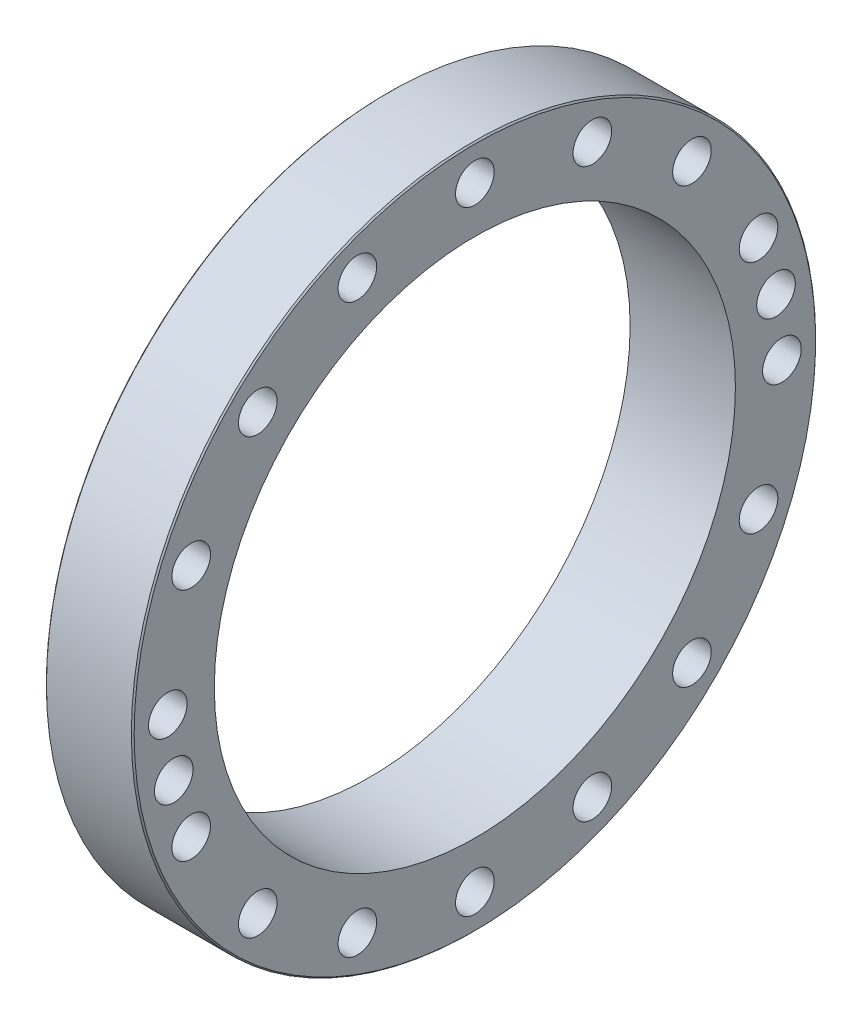
ISO-10303-21;
HEADER;
FILE_DESCRIPTION(('STEP AP214'),'2;1');
FILE_NAME('part.step','',(''),(''),'','','');
FILE_SCHEMA(('AUTOMOTIVE_DESIGN { 1 0 10303 214 1 1 1 1 }'));
ENDSEC;
DATA;
#1=APPLICATION_CONTEXT('core data for automotive mechanical design processes');
#2=APPLICATION_PROTOCOL_DEFINITION('international standard','automotive_design',2000,#1);
#3=PRODUCT_CONTEXT('',#1,'mechanical');
#4=PRODUCT('Part','Part','',(#3));
#5=PRODUCT_RELATED_PRODUCT_CATEGORY('part','',(#4));
#6=PRODUCT_DEFINITION_FORMATION('','',#4);
#7=PRODUCT_DEFINITION_CONTEXT('part definition',#1,'design');
#8=PRODUCT_DEFINITION('design','',#6,#7);
#9=PRODUCT_DEFINITION_SHAPE('','',#8);
#10=(LENGTH_UNIT() NAMED_UNIT(*) SI_UNIT(.MILLI.,.METRE.));
#11=(NAMED_UNIT(*) PLANE_ANGLE_UNIT() SI_UNIT($,.RADIAN.));
#12=(NAMED_UNIT(*) SI_UNIT($,.STERADIAN.) SOLID_ANGLE_UNIT());
#13=UNCERTAINTY_MEASURE_WITH_UNIT(LENGTH_MEASURE(1.E-05),#10,'distance_accuracy_value','');
#14=(GEOMETRIC_REPRESENTATION_CONTEXT(3) GLOBAL_UNCERTAINTY_ASSIGNED_CONTEXT((#13)) GLOBAL_UNIT_ASSIGNED_CONTEXT((#10,
#11,#12)) REPRESENTATION_CONTEXT('',''));
#15=CARTESIAN_POINT('',(0.,0.,0.));
#16=DIRECTION('',(0.,0.,1.));
#17=DIRECTION('',(1.,0.,0.));
#18=AXIS2_PLACEMENT_3D('',#15,#16,#17);
#19=CARTESIAN_POINT('',(55.6,-17.0704031764112,85.8187120352827));
#20=DIRECTION('',(-1.,0.,0.));
#21=DIRECTION('',(0.,0.,1.));
#22=AXIS2_PLACEMENT_3D('',#19,#20,#21);
#23=CYLINDRICAL_SURFACE('',#22,4.25);
#24=CARTESIAN_POINT('',(62.3499999999808,-17.0704031764112,85.8187120352827));
#25=DIRECTION('',(1.,0.,0.));
#26=DIRECTION('',(0.,0.195090322015708,-0.980785280403314));
#27=AXIS2_PLACEMENT_3D('',#24,#25,#26);
#28=CIRCLE('',#27,4.25000000001834);
#29=CARTESIAN_POINT('',(62.3499999999808,-16.2412693078409,81.6503745935506));
#30=VERTEX_POINT('',#29);
#31=EDGE_CURVE('E30',#30,#30,#28,.T.);
#32=ORIENTED_EDGE('',*,*,#31,.T.);
#33=EDGE_LOOP('',(#32));
#34=FACE_BOUND('',#33,.T.);
#35=CARTESIAN_POINT('',(48.8500000000158,-17.0704031764112,85.8187120352827));
#36=DIRECTION('',(-1.,0.,0.));
#37=DIRECTION('',(0.,0.195090322012491,-0.980785280403954));
#38=AXIS2_PLACEMENT_3D('',#35,#36,#37);
#39=CIRCLE('',#38,4.25000000001557);
#40=CARTESIAN_POINT('',(48.8500000000158,-16.2412693078551,81.6503745935506));
#41=VERTEX_POINT('',#40);
#42=EDGE_CURVE('E173',#41,#41,#39,.T.);
#43=ORIENTED_EDGE('',*,*,#42,.T.);
#44=EDGE_LOOP('',(#43));
#45=FACE_BOUND('',#44,.T.);
#46=ADVANCED_FACE('F15',(#34,#45),#23,.F.);
#47=CARTESIAN_POINT('',(55.6,17.0704031764112,-85.8187120352827));
#48=DIRECTION('',(-1.,0.,0.));
#49=DIRECTION('',(0.,0.,1.));
#50=AXIS2_PLACEMENT_3D('',#47,#48,#49);
#51=CYLINDRICAL_SURFACE('',#50,4.25);
#52=CARTESIAN_POINT('',(62.3499999999808,17.0704031764112,-85.8187120352827));
#53=DIRECTION('',(1.,0.,0.));
#54=DIRECTION('',(0.,-0.195090322015708,0.980785280403314));
#55=AXIS2_PLACEMENT_3D('',#52,#53,#54);
#56=CIRCLE('',#55,4.25000000001834);
#57=CARTESIAN_POINT('',(62.3499999999808,16.2412693078409,-81.6503745935506));
#58=VERTEX_POINT('',#57);
#59=EDGE_CURVE('E179',#58,#58,#56,.T.);
#60=ORIENTED_EDGE('',*,*,#59,.T.);
#61=EDGE_LOOP('',(#60));
#62=FACE_BOUND('',#61,.T.);
#63=CARTESIAN_POINT('',(48.8500000000158,17.0704031764112,-85.8187120352827));
#64=DIRECTION('',(-1.,0.,0.));
#65=DIRECTION('',(0.,-0.195090322012491,0.980785280403954));
#66=AXIS2_PLACEMENT_3D('',#63,#64,#65);
#67=CIRCLE('',#66,4.25000000001557);
#68=CARTESIAN_POINT('',(48.8500000000158,16.2412693078551,-81.6503745935506));
#69=VERTEX_POINT('',#68);
#70=EDGE_CURVE('E168',#69,#69,#67,.T.);
#71=ORIENTED_EDGE('',*,*,#70,.T.);
#72=EDGE_LOOP('',(#71));
#73=FACE_BOUND('',#72,.T.);
#74=ADVANCED_FACE('F191',(#62,#73),#51,.F.);
#75=CARTESIAN_POINT('',(63.0999999999062,-17.0704031764112,85.8187120352827));
#76=DIRECTION('',(1.,0.,0.));
#77=DIRECTION('',(0.,0.,-1.));
#78=AXIS2_PLACEMENT_3D('',#75,#76,#77);
#79=CONICAL_SURFACE('',#78,4.99999999996737,0.78539816341615);
#80=CARTESIAN_POINT('',(63.0999999999743,-17.0704031764112,85.8187120352827));
#81=DIRECTION('',(1.,0.,0.));
#82=DIRECTION('',(0.,0.,-1.));
#83=AXIS2_PLACEMENT_3D('',#80,#81,#82);
#84=CIRCLE('',#83,5.00000000003542);
#85=CARTESIAN_POINT('',(63.0999999999743,-17.0704031764112,80.8187120352473));
#86=VERTEX_POINT('',#85);
#87=EDGE_CURVE('E18',#86,#86,#84,.T.);
#88=ORIENTED_EDGE('',*,*,#87,.T.);
#89=EDGE_LOOP('',(#88));
#90=FACE_BOUND('',#89,.T.);
#91=ORIENTED_EDGE('',*,*,#31,.F.);
#92=EDGE_LOOP('',(#91));
#93=FACE_BOUND('',#92,.T.);
#94=ADVANCED_FACE('F188',(#90,#93),#79,.F.);
#95=CARTESIAN_POINT('',(63.0999999999062,17.0704031764112,-85.8187120352827));
#96=DIRECTION('',(1.,0.,0.));
#97=DIRECTION('',(0.,0.,-1.));
#98=AXIS2_PLACEMENT_3D('',#95,#96,#97);
#99=CONICAL_SURFACE('',#98,4.99999999996737,0.78539816341615);
#100=CARTESIAN_POINT('',(63.0999999999743,17.0704031764112,-85.8187120352827));
#101=DIRECTION('',(1.,0.,0.));
#102=DIRECTION('',(0.,0.,-1.));
#103=AXIS2_PLACEMENT_3D('',#100,#101,#102);
#104=CIRCLE('',#103,5.00000000003542);
#105=CARTESIAN_POINT('',(63.0999999999743,17.0704031764112,-90.8187120353181));
#106=VERTEX_POINT('',#105);
#107=EDGE_CURVE('E159',#106,#106,#104,.T.);
#108=ORIENTED_EDGE('',*,*,#107,.T.);
#109=EDGE_LOOP('',(#108));
#110=FACE_BOUND('',#109,.T.);
#111=ORIENTED_EDGE('',*,*,#59,.F.);
#112=EDGE_LOOP('',(#111));
#113=FACE_BOUND('',#112,.T.);
#114=ADVANCED_FACE('F190',(#110,#113),#99,.F.);
#115=CARTESIAN_POINT('',(48.1000000000336,-17.0704031764112,85.8187120352827));
#116=DIRECTION('',(-1.,0.,0.));
#117=DIRECTION('',(0.,0.,1.));
#118=AXIS2_PLACEMENT_3D('',#115,#116,#117);
#119=CONICAL_SURFACE('',#118,5.00000000002589,0.785398163416151);
#120=ORIENTED_EDGE('',*,*,#42,.F.);
#121=EDGE_LOOP('',(#120));
#122=FACE_BOUND('',#121,.T.);
#123=CARTESIAN_POINT('',(48.1000000000268,-17.0704031764112,85.8187120352827));
#124=DIRECTION('',(-1.,0.,0.));
#125=DIRECTION('',(0.,0.,1.));
#126=AXIS2_PLACEMENT_3D('',#123,#124,#125);
#127=CIRCLE('',#126,5.00000000003265);
#128=CARTESIAN_POINT('',(48.1000000000268,-17.0704031764112,90.8187120353153));
#129=VERTEX_POINT('',#128);
#130=EDGE_CURVE('E157',#129,#129,#127,.F.);
#131=ORIENTED_EDGE('',*,*,#130,.F.);
#132=EDGE_LOOP('',(#131));
#133=FACE_BOUND('',#132,.T.);
#134=ADVANCED_FACE('F198',(#122,#133),#119,.F.);
#135=CARTESIAN_POINT('',(48.1000000000336,17.0704031764112,-85.8187120352827));
#136=DIRECTION('',(-1.,0.,0.));
#137=DIRECTION('',(0.,0.,1.));
#138=AXIS2_PLACEMENT_3D('',#135,#136,#137);
#139=CONICAL_SURFACE('',#138,5.00000000002589,0.785398163416151);
#140=ORIENTED_EDGE('',*,*,#70,.F.);
#141=EDGE_LOOP('',(#140));
#142=FACE_BOUND('',#141,.T.);
#143=CARTESIAN_POINT('',(48.1000000000268,17.0704031764112,-85.8187120352827));
#144=DIRECTION('',(-1.,0.,0.));
#145=DIRECTION('',(0.,0.,1.));
#146=AXIS2_PLACEMENT_3D('',#143,#144,#145);
#147=CIRCLE('',#146,5.00000000003265);
#148=CARTESIAN_POINT('',(48.1000000000268,17.0704031764112,-80.8187120352501));
#149=VERTEX_POINT('',#148);
#150=EDGE_CURVE('E154',#149,#149,#147,.F.);
#151=ORIENTED_EDGE('',*,*,#150,.F.);
#152=EDGE_LOOP('',(#151));
#153=FACE_BOUND('',#152,.T.);
#154=ADVANCED_FACE('F317',(#142,#153),#139,.F.);
#155=CARTESIAN_POINT('',(46.,0.,0.));
#156=DIRECTION('',(-1.,0.,0.));
#157=DIRECTION('',(0.,0.,1.));
#158=AXIS2_PLACEMENT_3D('',#155,#156,#157);
#159=CYLINDRICAL_SURFACE('',#158,78.);
#160=CARTESIAN_POINT('',(48.1,0.,0.));
#161=DIRECTION('',(-1.,0.,0.));
#162=DIRECTION('',(0.,0.,1.));
#163=AXIS2_PLACEMENT_3D('',#160,#161,#162);
#164=CIRCLE('',#163,78.);
#165=CARTESIAN_POINT('',(48.1,0.,78.));
#166=VERTEX_POINT('',#165);
#167=EDGE_CURVE('E148',#166,#166,#164,.F.);
#168=ORIENTED_EDGE('',*,*,#167,.F.);
#169=EDGE_LOOP('',(#168));
#170=FACE_BOUND('',#169,.T.);
#171=CARTESIAN_POINT('',(43.9,0.,0.));
#172=DIRECTION('',(1.,0.,0.));
#173=DIRECTION('',(0.,0.,1.));
#174=AXIS2_PLACEMENT_3D('',#171,#172,#173);
#175=CIRCLE('',#174,78.);
#176=CARTESIAN_POINT('',(43.9,0.,78.));
#177=VERTEX_POINT('',#176);
#178=EDGE_CURVE('E164',#177,#177,#175,.F.);
#179=ORIENTED_EDGE('',*,*,#178,.F.);
#180=EDGE_LOOP('',(#179));
#181=FACE_BOUND('',#180,.T.);
#182=ADVANCED_FACE('F314',(#170,#181),#159,.T.);
#183=CARTESIAN_POINT('',(43.9,0.,0.));
#184=DIRECTION('',(1.,0.,0.));
#185=DIRECTION('',(0.,0.,-1.));
#186=AXIS2_PLACEMENT_3D('',#183,#184,#185);
#187=CONICAL_SURFACE('',#186,78.,0.785398163397448);
#188=ORIENTED_EDGE('',*,*,#178,.T.);
#189=EDGE_LOOP('',(#188));
#190=FACE_BOUND('',#189,.T.);
#191=CARTESIAN_POINT('',(43.1,0.,0.));
#192=DIRECTION('',(1.,0.,0.));
#193=DIRECTION('',(0.,0.,-1.));
#194=AXIS2_PLACEMENT_3D('',#191,#192,#193);
#195=CIRCLE('',#194,77.2);
#196=CARTESIAN_POINT('',(43.1,0.,-77.2));
#197=VERTEX_POINT('',#196);
#198=EDGE_CURVE('E145',#197,#197,#195,.F.);
#199=ORIENTED_EDGE('',*,*,#198,.F.);
#200=EDGE_LOOP('',(#199));
#201=FACE_BOUND('',#200,.T.);
#202=ADVANCED_FACE('F310',(#190,#201),#187,.T.);
#203=CARTESIAN_POINT('',(48.5,0.,0.));
#204=DIRECTION('',(1.,0.,0.));
#205=DIRECTION('',(0.,0.,-1.));
#206=AXIS2_PLACEMENT_3D('',#203,#204,#205);
#207=CONICAL_SURFACE('',#206,97.5,0.785398163397448);
#208=CARTESIAN_POINT('',(48.5,0.,0.));
#209=DIRECTION('',(-1.,0.,0.));
#210=DIRECTION('',(0.,0.,1.));
#211=AXIS2_PLACEMENT_3D('',#208,#209,#210);
#212=CIRCLE('',#211,97.5);
#213=CARTESIAN_POINT('',(48.5,0.,97.5));
#214=VERTEX_POINT('',#213);
#215=EDGE_CURVE('E144',#214,#214,#212,.F.);
#216=ORIENTED_EDGE('',*,*,#215,.F.);
#217=EDGE_LOOP('',(#216));
#218=FACE_BOUND('',#217,.T.);
#219=CARTESIAN_POINT('',(48.1,0.,0.));
#220=DIRECTION('',(1.,0.,0.));
#221=DIRECTION('',(0.,0.,-1.));
#222=AXIS2_PLACEMENT_3D('',#219,#220,#221);
#223=CIRCLE('',#222,97.1);
#224=CARTESIAN_POINT('',(48.1,0.,-97.1));
#225=VERTEX_POINT('',#224);
#226=EDGE_CURVE('E151',#225,#225,#223,.F.);
#227=ORIENTED_EDGE('',*,*,#226,.F.);
#228=EDGE_LOOP('',(#227));
#229=FACE_BOUND('',#228,.T.);
#230=ADVANCED_FACE('F306',(#218,#229),#207,.T.);
#231=CARTESIAN_POINT('',(63.1,-17.6069015619556,88.5158715563915));
#232=DIRECTION('',(-1.,0.,0.));
#233=DIRECTION('',(0.,0.,1.));
#234=AXIS2_PLACEMENT_3D('',#231,#232,#233);
#235=PLANE('',#234);
#236=CARTESIAN_POINT('',(63.1,-17.0704031764112,85.8187120352827));
#237=DIRECTION('',(-1.,0.,0.));
#238=DIRECTION('',(0.,0.,1.));
#239=AXIS2_PLACEMENT_3D('',#236,#237,#238);
#240=CIRCLE('',#239,5.5);
#241=CARTESIAN_POINT('',(63.1,-17.0704031764112,91.3187120352827));
#242=VERTEX_POINT('',#241);
#243=EDGE_CURVE('E141',#242,#242,#240,.F.);
#244=ORIENTED_EDGE('',*,*,#243,.T.);
#245=EDGE_LOOP('',(#244));
#246=FACE_BOUND('',#245,.T.);
#247=ORIENTED_EDGE('',*,*,#87,.F.);
#248=EDGE_LOOP('',(#247));
#249=FACE_BOUND('',#248,.T.);
#250=ADVANCED_FACE('F302',(#246,#249),#235,.F.);
#251=CARTESIAN_POINT('',(63.1,17.6069015619556,-88.5158715563915));
#252=DIRECTION('',(-1.,0.,0.));
#253=DIRECTION('',(0.,0.,1.));
#254=AXIS2_PLACEMENT_3D('',#251,#252,#253);
#255=PLANE('',#254);
#256=CARTESIAN_POINT('',(63.1,17.0704031764112,-85.8187120352827));
#257=DIRECTION('',(-1.,0.,0.));
#258=DIRECTION('',(0.,0.,1.));
#259=AXIS2_PLACEMENT_3D('',#256,#257,#258);
#260=CIRCLE('',#259,5.5);
#261=CARTESIAN_POINT('',(63.1,17.0704031764112,-80.3187120352827));
#262=VERTEX_POINT('',#261);
#263=EDGE_CURVE('E138',#262,#262,#260,.F.);
#264=ORIENTED_EDGE('',*,*,#263,.T.);
#265=EDGE_LOOP('',(#264));
#266=FACE_BOUND('',#265,.T.);
#267=ORIENTED_EDGE('',*,*,#107,.F.);
#268=EDGE_LOOP('',(#267));
#269=FACE_BOUND('',#268,.T.);
#270=ADVANCED_FACE('F298',(#266,#269),#255,.F.);
#271=CARTESIAN_POINT('',(48.1,0.,87.55));
#272=DIRECTION('',(-1.,0.,0.));
#273=DIRECTION('',(0.,0.,1.));
#274=AXIS2_PLACEMENT_3D('',#271,#272,#273);
#275=PLANE('',#274);
#276=ORIENTED_EDGE('',*,*,#167,.T.);
#277=EDGE_LOOP('',(#276));
#278=FACE_BOUND('',#277,.T.);
#279=ORIENTED_EDGE('',*,*,#226,.T.);
#280=EDGE_LOOP('',(#279));
#281=FACE_BOUND('',#280,.T.);
#282=CARTESIAN_POINT('',(48.1,0.,-87.5));
#283=DIRECTION('',(-1.,0.,0.));
#284=DIRECTION('',(0.,0.,1.));
#285=AXIS2_PLACEMENT_3D('',#282,#283,#284);
#286=CIRCLE('',#285,5.5);
#287=CARTESIAN_POINT('',(48.1,0.,-82.));
#288=VERTEX_POINT('',#287);
#289=EDGE_CURVE('E90',#288,#288,#286,.F.);
#290=ORIENTED_EDGE('',*,*,#289,.T.);
#291=EDGE_LOOP('',(#290));
#292=FACE_BOUND('',#291,.T.);
#293=CARTESIAN_POINT('',(48.1,33.4848003319454,-80.8394590947376));
#294=DIRECTION('',(-1.,0.,0.));
#295=DIRECTION('',(0.,0.,1.));
#296=AXIS2_PLACEMENT_3D('',#293,#294,#295);
#297=CIRCLE('',#296,5.5);
#298=CARTESIAN_POINT('',(48.1,33.4848003319454,-75.3394590947376));
#299=VERTEX_POINT('',#298);
#300=EDGE_CURVE('E93',#299,#299,#297,.F.);
#301=ORIENTED_EDGE('',*,*,#300,.T.);
#302=EDGE_LOOP('',(#301));
#303=FACE_BOUND('',#302,.T.);
#304=CARTESIAN_POINT('',(48.1,61.8718433538229,-61.8718433538229));
#305=DIRECTION('',(-1.,0.,0.));
#306=DIRECTION('',(0.,0.,1.));
#307=AXIS2_PLACEMENT_3D('',#304,#305,#306);
#308=CIRCLE('',#307,5.5);
#309=CARTESIAN_POINT('',(48.1,61.8718433538229,-56.3718433538229));
#310=VERTEX_POINT('',#309);
#311=EDGE_CURVE('E96',#310,#310,#308,.F.);
#312=ORIENTED_EDGE('',*,*,#311,.T.);
#313=EDGE_LOOP('',(#312));
#314=FACE_BOUND('',#313,.T.);
#315=CARTESIAN_POINT('',(48.1,80.8394590947376,-33.4848003319454));
#316=DIRECTION('',(-1.,0.,0.));
#317=DIRECTION('',(0.,0.,1.));
#318=AXIS2_PLACEMENT_3D('',#315,#316,#317);
#319=CIRCLE('',#318,5.5);
#320=CARTESIAN_POINT('',(48.1,80.8394590947376,-27.9848003319454));
#321=VERTEX_POINT('',#320);
#322=EDGE_CURVE('E99',#321,#321,#319,.F.);
#323=ORIENTED_EDGE('',*,*,#322,.T.);
#324=EDGE_LOOP('',(#323));
#325=FACE_BOUND('',#324,.T.);
#326=CARTESIAN_POINT('',(48.1,87.5,0.));
#327=DIRECTION('',(-1.,0.,0.));
#328=DIRECTION('',(0.,0.,1.));
#329=AXIS2_PLACEMENT_3D('',#326,#327,#328);
#330=CIRCLE('',#329,5.5);
#331=CARTESIAN_POINT('',(48.1,87.5,5.5));
#332=VERTEX_POINT('',#331);
#333=EDGE_CURVE('E102',#332,#332,#330,.F.);
#334=ORIENTED_EDGE('',*,*,#333,.T.);
#335=EDGE_LOOP('',(#334));
#336=FACE_BOUND('',#335,.T.);
#337=CARTESIAN_POINT('',(48.1,80.8394590947376,33.4848003319454));
#338=DIRECTION('',(-1.,0.,0.));
#339=DIRECTION('',(0.,0.,1.));
#340=AXIS2_PLACEMENT_3D('',#337,#338,#339);
#341=CIRCLE('',#340,5.5);
#342=CARTESIAN_POINT('',(48.1,80.8394590947376,38.9848003319454));
#343=VERTEX_POINT('',#342);
#344=EDGE_CURVE('E105',#343,#343,#341,.F.);
#345=ORIENTED_EDGE('',*,*,#344,.T.);
#346=EDGE_LOOP('',(#345));
#347=FACE_BOUND('',#346,.T.);
#348=CARTESIAN_POINT('',(48.1,61.8718433538229,61.8718433538229));
#349=DIRECTION('',(-1.,0.,0.));
#350=DIRECTION('',(0.,0.,1.));
#351=AXIS2_PLACEMENT_3D('',#348,#349,#350);
#352=CIRCLE('',#351,5.5);
#353=CARTESIAN_POINT('',(48.1,61.8718433538229,67.3718433538229));
#354=VERTEX_POINT('',#353);
#355=EDGE_CURVE('E108',#354,#354,#352,.F.);
#356=ORIENTED_EDGE('',*,*,#355,.T.);
#357=EDGE_LOOP('',(#356));
#358=FACE_BOUND('',#357,.T.);
#359=CARTESIAN_POINT('',(48.1,33.4848003319453,80.8394590947376));
#360=DIRECTION('',(-1.,0.,0.));
#361=DIRECTION('',(0.,0.,1.));
#362=AXIS2_PLACEMENT_3D('',#359,#360,#361);
#363=CIRCLE('',#362,5.5);
#364=CARTESIAN_POINT('',(48.1,33.4848003319453,86.3394590947376));
#365=VERTEX_POINT('',#364);
#366=EDGE_CURVE('E111',#365,#365,#363,.F.);
#367=ORIENTED_EDGE('',*,*,#366,.T.);
#368=EDGE_LOOP('',(#367));
#369=FACE_BOUND('',#368,.T.);
#370=CARTESIAN_POINT('',(48.1,0.,87.5));
#371=DIRECTION('',(-1.,0.,0.));
#372=DIRECTION('',(0.,0.,1.));
#373=AXIS2_PLACEMENT_3D('',#370,#371,#372);
#374=CIRCLE('',#373,5.5);
#375=CARTESIAN_POINT('',(48.1,0.,93.));
#376=VERTEX_POINT('',#375);
#377=EDGE_CURVE('E114',#376,#376,#374,.F.);
#378=ORIENTED_EDGE('',*,*,#377,.T.);
#379=EDGE_LOOP('',(#378));
#380=FACE_BOUND('',#379,.T.);
#381=CARTESIAN_POINT('',(48.1,-33.4848003319453,80.8394590947376));
#382=DIRECTION('',(-1.,0.,0.));
#383=DIRECTION('',(0.,0.,1.));
#384=AXIS2_PLACEMENT_3D('',#381,#382,#383);
#385=CIRCLE('',#384,5.5);
#386=CARTESIAN_POINT('',(48.1,-33.4848003319453,86.3394590947376));
#387=VERTEX_POINT('',#386);
#388=EDGE_CURVE('E117',#387,#387,#385,.F.);
#389=ORIENTED_EDGE('',*,*,#388,.T.);
#390=EDGE_LOOP('',(#389));
#391=FACE_BOUND('',#390,.T.);
#392=CARTESIAN_POINT('',(48.1,-61.8718433538229,61.8718433538229));
#393=DIRECTION('',(-1.,0.,0.));
#394=DIRECTION('',(0.,0.,1.));
#395=AXIS2_PLACEMENT_3D('',#392,#393,#394);
#396=CIRCLE('',#395,5.5);
#397=CARTESIAN_POINT('',(48.1,-61.8718433538229,67.3718433538229));
#398=VERTEX_POINT('',#397);
#399=EDGE_CURVE('E120',#398,#398,#396,.F.);
#400=ORIENTED_EDGE('',*,*,#399,.T.);
#401=EDGE_LOOP('',(#400));
#402=FACE_BOUND('',#401,.T.);
#403=CARTESIAN_POINT('',(48.1,-80.8394590947376,33.4848003319453));
#404=DIRECTION('',(-1.,0.,0.));
#405=DIRECTION('',(0.,0.,1.));
#406=AXIS2_PLACEMENT_3D('',#403,#404,#405);
#407=CIRCLE('',#406,5.5);
#408=CARTESIAN_POINT('',(48.1,-80.8394590947376,38.9848003319453));
#409=VERTEX_POINT('',#408);
#410=EDGE_CURVE('E123',#409,#409,#407,.F.);
#411=ORIENTED_EDGE('',*,*,#410,.T.);
#412=EDGE_LOOP('',(#411));
#413=FACE_BOUND('',#412,.T.);
#414=CARTESIAN_POINT('',(48.1,-87.5,0.));
#415=DIRECTION('',(-1.,0.,0.));
#416=DIRECTION('',(0.,0.,1.));
#417=AXIS2_PLACEMENT_3D('',#414,#415,#416);
#418=CIRCLE('',#417,5.5);
#419=CARTESIAN_POINT('',(48.1,-87.5,5.5));
#420=VERTEX_POINT('',#419);
#421=EDGE_CURVE('E126',#420,#420,#418,.F.);
#422=ORIENTED_EDGE('',*,*,#421,.T.);
#423=EDGE_LOOP('',(#422));
#424=FACE_BOUND('',#423,.T.);
#425=CARTESIAN_POINT('',(48.1,-80.8394590947376,-33.4848003319454));
#426=DIRECTION('',(-1.,0.,0.));
#427=DIRECTION('',(0.,0.,1.));
#428=AXIS2_PLACEMENT_3D('',#425,#426,#427);
#429=CIRCLE('',#428,5.5);
#430=CARTESIAN_POINT('',(48.1,-80.8394590947376,-27.9848003319454));
#431=VERTEX_POINT('',#430);
#432=EDGE_CURVE('E129',#431,#431,#429,.F.);
#433=ORIENTED_EDGE('',*,*,#432,.T.);
#434=EDGE_LOOP('',(#433));
#435=FACE_BOUND('',#434,.T.);
#436=CARTESIAN_POINT('',(48.1,-61.8718433538229,-61.871843353823));
#437=DIRECTION('',(-1.,0.,0.));
#438=DIRECTION('',(0.,0.,1.));
#439=AXIS2_PLACEMENT_3D('',#436,#437,#438);
#440=CIRCLE('',#439,5.5);
#441=CARTESIAN_POINT('',(48.1,-61.8718433538229,-56.371843353823));
#442=VERTEX_POINT('',#441);
#443=EDGE_CURVE('E132',#442,#442,#440,.F.);
#444=ORIENTED_EDGE('',*,*,#443,.T.);
#445=EDGE_LOOP('',(#444));
#446=FACE_BOUND('',#445,.T.);
#447=CARTESIAN_POINT('',(48.1,-33.4848003319453,-80.8394590947376));
#448=DIRECTION('',(-1.,0.,0.));
#449=DIRECTION('',(0.,0.,1.));
#450=AXIS2_PLACEMENT_3D('',#447,#448,#449);
#451=CIRCLE('',#450,5.5);
#452=CARTESIAN_POINT('',(48.1,-33.4848003319453,-75.3394590947376));
#453=VERTEX_POINT('',#452);
#454=EDGE_CURVE('E135',#453,#453,#451,.F.);
#455=ORIENTED_EDGE('',*,*,#454,.T.);
#456=EDGE_LOOP('',(#455));
#457=FACE_BOUND('',#456,.T.);
#458=ORIENTED_EDGE('',*,*,#150,.T.);
#459=EDGE_LOOP('',(#458));
#460=FACE_BOUND('',#459,.T.);
#461=ORIENTED_EDGE('',*,*,#130,.T.);
#462=EDGE_LOOP('',(#461));
#463=FACE_BOUND('',#462,.T.);
#464=ADVANCED_FACE('F294',(#278,#281,#292,#303,#314,#325,#336,#347,#358,#369,#380,#391,#402,
#413,#424,#435,#446,#457,#460,#463),#275,.T.);
#465=CARTESIAN_POINT('',(43.1,0.,75.7265));
#466=DIRECTION('',(-1.,0.,0.));
#467=DIRECTION('',(0.,0.,1.));
#468=AXIS2_PLACEMENT_3D('',#465,#466,#467);
#469=PLANE('',#468);
#470=CARTESIAN_POINT('',(43.1,0.,0.));
#471=DIRECTION('',(-1.,0.,0.));
#472=DIRECTION('',(0.,0.,1.));
#473=AXIS2_PLACEMENT_3D('',#470,#471,#472);
#474=CIRCLE('',#473,74.253);
#475=CARTESIAN_POINT('',(43.1,0.,74.253));
#476=VERTEX_POINT('',#475);
#477=EDGE_CURVE('E87',#476,#476,#474,.F.);
#478=ORIENTED_EDGE('',*,*,#477,.T.);
#479=EDGE_LOOP('',(#478));
#480=FACE_BOUND('',#479,.T.);
#481=ORIENTED_EDGE('',*,*,#198,.T.);
#482=EDGE_LOOP('',(#481));
#483=FACE_BOUND('',#482,.T.);
#484=ADVANCED_FACE('F290',(#480,#483),#469,.T.);
#485=CARTESIAN_POINT('',(60.6,0.,0.));
#486=DIRECTION('',(-1.,0.,0.));
#487=DIRECTION('',(0.,0.,1.));
#488=AXIS2_PLACEMENT_3D('',#485,#486,#487);
#489=CYLINDRICAL_SURFACE('',#488,97.5);
#490=CARTESIAN_POINT('',(72.7,0.,0.));
#491=DIRECTION('',(-1.,0.,0.));
#492=DIRECTION('',(0.,0.,1.));
#493=AXIS2_PLACEMENT_3D('',#490,#491,#492);
#494=CIRCLE('',#493,97.5);
#495=CARTESIAN_POINT('',(72.7,0.,97.5));
#496=VERTEX_POINT('',#495);
#497=EDGE_CURVE('E86',#496,#496,#494,.F.);
#498=ORIENTED_EDGE('',*,*,#497,.F.);
#499=EDGE_LOOP('',(#498));
#500=FACE_BOUND('',#499,.T.);
#501=ORIENTED_EDGE('',*,*,#215,.T.);
#502=EDGE_LOOP('',(#501));
#503=FACE_BOUND('',#502,.T.);
#504=ADVANCED_FACE('F286',(#500,#503),#489,.T.);
#505=CARTESIAN_POINT('',(68.1,-17.0704031764112,85.8187120352827));
#506=DIRECTION('',(-1.,0.,0.));
#507=DIRECTION('',(0.,0.,1.));
#508=AXIS2_PLACEMENT_3D('',#505,#506,#507);
#509=CYLINDRICAL_SURFACE('',#508,5.5);
#510=CARTESIAN_POINT('',(73.1,-17.0704031764112,85.8187120352827));
#511=DIRECTION('',(-1.,0.,0.));
#512=DIRECTION('',(0.,0.,1.));
#513=AXIS2_PLACEMENT_3D('',#510,#511,#512);
#514=CIRCLE('',#513,5.5);
#515=CARTESIAN_POINT('',(73.1,-17.0704031764112,91.3187120352827));
#516=VERTEX_POINT('',#515);
#517=EDGE_CURVE('E83',#516,#516,#514,.T.);
#518=ORIENTED_EDGE('',*,*,#517,.F.);
#519=EDGE_LOOP('',(#518));
#520=FACE_BOUND('',#519,.T.);
#521=ORIENTED_EDGE('',*,*,#243,.F.);
#522=EDGE_LOOP('',(#521));
#523=FACE_BOUND('',#522,.T.);
#524=ADVANCED_FACE('F282',(#520,#523),#509,.F.);
#525=CARTESIAN_POINT('',(68.1,17.0704031764112,-85.8187120352827));
#526=DIRECTION('',(-1.,0.,0.));
#527=DIRECTION('',(0.,0.,1.));
#528=AXIS2_PLACEMENT_3D('',#525,#526,#527);
#529=CYLINDRICAL_SURFACE('',#528,5.5);
#530=CARTESIAN_POINT('',(73.1,17.0704031764112,-85.8187120352827));
#531=DIRECTION('',(-1.,0.,0.));
#532=DIRECTION('',(0.,0.,1.));
#533=AXIS2_PLACEMENT_3D('',#530,#531,#532);
#534=CIRCLE('',#533,5.5);
#535=CARTESIAN_POINT('',(73.1,17.0704031764112,-80.3187120352827));
#536=VERTEX_POINT('',#535);
#537=EDGE_CURVE('E80',#536,#536,#534,.T.);
#538=ORIENTED_EDGE('',*,*,#537,.F.);
#539=EDGE_LOOP('',(#538));
#540=FACE_BOUND('',#539,.T.);
#541=ORIENTED_EDGE('',*,*,#263,.F.);
#542=EDGE_LOOP('',(#541));
#543=FACE_BOUND('',#542,.T.);
#544=ADVANCED_FACE('F278',(#540,#543),#529,.F.);
#545=CARTESIAN_POINT('',(60.6,-33.4848003319453,-80.8394590947376));
#546=DIRECTION('',(-1.,0.,0.));
#547=DIRECTION('',(0.,0.,1.));
#548=AXIS2_PLACEMENT_3D('',#545,#546,#547);
#549=CYLINDRICAL_SURFACE('',#548,5.5);
#550=CARTESIAN_POINT('',(73.1,-33.4848003319453,-80.8394590947376));
#551=DIRECTION('',(-1.,0.,0.));
#552=DIRECTION('',(0.,0.,1.));
#553=AXIS2_PLACEMENT_3D('',#550,#551,#552);
#554=CIRCLE('',#553,5.5);
#555=CARTESIAN_POINT('',(73.1,-33.4848003319453,-75.3394590947376));
#556=VERTEX_POINT('',#555);
#557=EDGE_CURVE('E77',#556,#556,#554,.T.);
#558=ORIENTED_EDGE('',*,*,#557,.F.);
#559=EDGE_LOOP('',(#558));
#560=FACE_BOUND('',#559,.T.);
#561=ORIENTED_EDGE('',*,*,#454,.F.);
#562=EDGE_LOOP('',(#561));
#563=FACE_BOUND('',#562,.T.);
#564=ADVANCED_FACE('F274',(#560,#563),#549,.F.);
#565=CARTESIAN_POINT('',(60.6,-61.8718433538229,-61.871843353823));
#566=DIRECTION('',(-1.,0.,0.));
#567=DIRECTION('',(0.,0.,1.));
#568=AXIS2_PLACEMENT_3D('',#565,#566,#567);
#569=CYLINDRICAL_SURFACE('',#568,5.5);
#570=CARTESIAN_POINT('',(73.1,-61.8718433538229,-61.871843353823));
#571=DIRECTION('',(-1.,0.,0.));
#572=DIRECTION('',(0.,0.,1.));
#573=AXIS2_PLACEMENT_3D('',#570,#571,#572);
#574=CIRCLE('',#573,5.5);
#575=CARTESIAN_POINT('',(73.1,-61.8718433538229,-56.371843353823));
#576=VERTEX_POINT('',#575);
#577=EDGE_CURVE('E74',#576,#576,#574,.T.);
#578=ORIENTED_EDGE('',*,*,#577,.F.);
#579=EDGE_LOOP('',(#578));
#580=FACE_BOUND('',#579,.T.);
#581=ORIENTED_EDGE('',*,*,#443,.F.);
#582=EDGE_LOOP('',(#581));
#583=FACE_BOUND('',#582,.T.);
#584=ADVANCED_FACE('F270',(#580,#583),#569,.F.);
#585=CARTESIAN_POINT('',(60.6,-80.8394590947376,-33.4848003319454));
#586=DIRECTION('',(-1.,0.,0.));
#587=DIRECTION('',(0.,0.,1.));
#588=AXIS2_PLACEMENT_3D('',#585,#586,#587);
#589=CYLINDRICAL_SURFACE('',#588,5.5);
#590=CARTESIAN_POINT('',(73.1,-80.8394590947376,-33.4848003319454));
#591=DIRECTION('',(-1.,0.,0.));
#592=DIRECTION('',(0.,0.,1.));
#593=AXIS2_PLACEMENT_3D('',#590,#591,#592);
#594=CIRCLE('',#593,5.5);
#595=CARTESIAN_POINT('',(73.1,-80.8394590947376,-27.9848003319454));
#596=VERTEX_POINT('',#595);
#597=EDGE_CURVE('E71',#596,#596,#594,.T.);
#598=ORIENTED_EDGE('',*,*,#597,.F.);
#599=EDGE_LOOP('',(#598));
#600=FACE_BOUND('',#599,.T.);
#601=ORIENTED_EDGE('',*,*,#432,.F.);
#602=EDGE_LOOP('',(#601));
#603=FACE_BOUND('',#602,.T.);
#604=ADVANCED_FACE('F266',(#600,#603),#589,.F.);
#605=CARTESIAN_POINT('',(60.6,-87.5,0.));
#606=DIRECTION('',(-1.,0.,0.));
#607=DIRECTION('',(0.,0.,1.));
#608=AXIS2_PLACEMENT_3D('',#605,#606,#607);
#609=CYLINDRICAL_SURFACE('',#608,5.5);
#610=CARTESIAN_POINT('',(73.1,-87.5,0.));
#611=DIRECTION('',(-1.,0.,0.));
#612=DIRECTION('',(0.,0.,1.));
#613=AXIS2_PLACEMENT_3D('',#610,#611,#612);
#614=CIRCLE('',#613,5.5);
#615=CARTESIAN_POINT('',(73.1,-87.5,5.5));
#616=VERTEX_POINT('',#615);
#617=EDGE_CURVE('E68',#616,#616,#614,.T.);
#618=ORIENTED_EDGE('',*,*,#617,.F.);
#619=EDGE_LOOP('',(#618));
#620=FACE_BOUND('',#619,.T.);
#621=ORIENTED_EDGE('',*,*,#421,.F.);
#622=EDGE_LOOP('',(#621));
#623=FACE_BOUND('',#622,.T.);
#624=ADVANCED_FACE('F262',(#620,#623),#609,.F.);
#625=CARTESIAN_POINT('',(60.6,-80.8394590947376,33.4848003319453));
#626=DIRECTION('',(-1.,0.,0.));
#627=DIRECTION('',(0.,0.,1.));
#628=AXIS2_PLACEMENT_3D('',#625,#626,#627);
#629=CYLINDRICAL_SURFACE('',#628,5.5);
#630=CARTESIAN_POINT('',(73.1,-80.8394590947376,33.4848003319453));
#631=DIRECTION('',(-1.,0.,0.));
#632=DIRECTION('',(0.,0.,1.));
#633=AXIS2_PLACEMENT_3D('',#630,#631,#632);
#634=CIRCLE('',#633,5.5);
#635=CARTESIAN_POINT('',(73.1,-80.8394590947376,38.9848003319453));
#636=VERTEX_POINT('',#635);
#637=EDGE_CURVE('E65',#636,#636,#634,.T.);
#638=ORIENTED_EDGE('',*,*,#637,.F.);
#639=EDGE_LOOP('',(#638));
#640=FACE_BOUND('',#639,.T.);
#641=ORIENTED_EDGE('',*,*,#410,.F.);
#642=EDGE_LOOP('',(#641));
#643=FACE_BOUND('',#642,.T.);
#644=ADVANCED_FACE('F258',(#640,#643),#629,.F.);
#645=CARTESIAN_POINT('',(60.6,-61.8718433538229,61.8718433538229));
#646=DIRECTION('',(-1.,0.,0.));
#647=DIRECTION('',(0.,0.,1.));
#648=AXIS2_PLACEMENT_3D('',#645,#646,#647);
#649=CYLINDRICAL_SURFACE('',#648,5.5);
#650=CARTESIAN_POINT('',(73.1,-61.8718433538229,61.8718433538229));
#651=DIRECTION('',(-1.,0.,0.));
#652=DIRECTION('',(0.,0.,1.));
#653=AXIS2_PLACEMENT_3D('',#650,#651,#652);
#654=CIRCLE('',#653,5.5);
#655=CARTESIAN_POINT('',(73.1,-61.8718433538229,67.3718433538229));
#656=VERTEX_POINT('',#655);
#657=EDGE_CURVE('E62',#656,#656,#654,.T.);
#658=ORIENTED_EDGE('',*,*,#657,.F.);
#659=EDGE_LOOP('',(#658));
#660=FACE_BOUND('',#659,.T.);
#661=ORIENTED_EDGE('',*,*,#399,.F.);
#662=EDGE_LOOP('',(#661));
#663=FACE_BOUND('',#662,.T.);
#664=ADVANCED_FACE('F254',(#660,#663),#649,.F.);
#665=CARTESIAN_POINT('',(60.6,-33.4848003319453,80.8394590947376));
#666=DIRECTION('',(-1.,0.,0.));
#667=DIRECTION('',(0.,0.,1.));
#668=AXIS2_PLACEMENT_3D('',#665,#666,#667);
#669=CYLINDRICAL_SURFACE('',#668,5.5);
#670=CARTESIAN_POINT('',(73.1,-33.4848003319453,80.8394590947376));
#671=DIRECTION('',(-1.,0.,0.));
#672=DIRECTION('',(0.,0.,1.));
#673=AXIS2_PLACEMENT_3D('',#670,#671,#672);
#674=CIRCLE('',#673,5.5);
#675=CARTESIAN_POINT('',(73.1,-33.4848003319453,86.3394590947376));
#676=VERTEX_POINT('',#675);
#677=EDGE_CURVE('E59',#676,#676,#674,.T.);
#678=ORIENTED_EDGE('',*,*,#677,.F.);
#679=EDGE_LOOP('',(#678));
#680=FACE_BOUND('',#679,.T.);
#681=ORIENTED_EDGE('',*,*,#388,.F.);
#682=EDGE_LOOP('',(#681));
#683=FACE_BOUND('',#682,.T.);
#684=ADVANCED_FACE('F250',(#680,#683),#669,.F.);
#685=CARTESIAN_POINT('',(60.6,0.,87.5));
#686=DIRECTION('',(-1.,0.,0.));
#687=DIRECTION('',(0.,0.,1.));
#688=AXIS2_PLACEMENT_3D('',#685,#686,#687);
#689=CYLINDRICAL_SURFACE('',#688,5.5);
#690=CARTESIAN_POINT('',(73.1,0.,87.5));
#691=DIRECTION('',(-1.,0.,0.));
#692=DIRECTION('',(0.,0.,1.));
#693=AXIS2_PLACEMENT_3D('',#690,#691,#692);
#694=CIRCLE('',#693,5.5);
#695=CARTESIAN_POINT('',(73.1,0.,93.));
#696=VERTEX_POINT('',#695);
#697=EDGE_CURVE('E56',#696,#696,#694,.T.);
#698=ORIENTED_EDGE('',*,*,#697,.F.);
#699=EDGE_LOOP('',(#698));
#700=FACE_BOUND('',#699,.T.);
#701=ORIENTED_EDGE('',*,*,#377,.F.);
#702=EDGE_LOOP('',(#701));
#703=FACE_BOUND('',#702,.T.);
#704=ADVANCED_FACE('F246',(#700,#703),#689,.F.);
#705=CARTESIAN_POINT('',(60.6,33.4848003319453,80.8394590947376));
#706=DIRECTION('',(-1.,0.,0.));
#707=DIRECTION('',(0.,0.,1.));
#708=AXIS2_PLACEMENT_3D('',#705,#706,#707);
#709=CYLINDRICAL_SURFACE('',#708,5.5);
#710=CARTESIAN_POINT('',(73.1,33.4848003319453,80.8394590947376));
#711=DIRECTION('',(-1.,0.,0.));
#712=DIRECTION('',(0.,0.,1.));
#713=AXIS2_PLACEMENT_3D('',#710,#711,#712);
#714=CIRCLE('',#713,5.5);
#715=CARTESIAN_POINT('',(73.1,33.4848003319453,86.3394590947376));
#716=VERTEX_POINT('',#715);
#717=EDGE_CURVE('E53',#716,#716,#714,.T.);
#718=ORIENTED_EDGE('',*,*,#717,.F.);
#719=EDGE_LOOP('',(#718));
#720=FACE_BOUND('',#719,.T.);
#721=ORIENTED_EDGE('',*,*,#366,.F.);
#722=EDGE_LOOP('',(#721));
#723=FACE_BOUND('',#722,.T.);
#724=ADVANCED_FACE('F242',(#720,#723),#709,.F.);
#725=CARTESIAN_POINT('',(60.6,61.8718433538229,61.8718433538229));
#726=DIRECTION('',(-1.,0.,0.));
#727=DIRECTION('',(0.,0.,1.));
#728=AXIS2_PLACEMENT_3D('',#725,#726,#727);
#729=CYLINDRICAL_SURFACE('',#728,5.5);
#730=CARTESIAN_POINT('',(73.1,61.8718433538229,61.8718433538229));
#731=DIRECTION('',(-1.,0.,0.));
#732=DIRECTION('',(0.,0.,1.));
#733=AXIS2_PLACEMENT_3D('',#730,#731,#732);
#734=CIRCLE('',#733,5.5);
#735=CARTESIAN_POINT('',(73.1,61.8718433538229,67.3718433538229));
#736=VERTEX_POINT('',#735);
#737=EDGE_CURVE('E50',#736,#736,#734,.T.);
#738=ORIENTED_EDGE('',*,*,#737,.F.);
#739=EDGE_LOOP('',(#738));
#740=FACE_BOUND('',#739,.T.);
#741=ORIENTED_EDGE('',*,*,#355,.F.);
#742=EDGE_LOOP('',(#741));
#743=FACE_BOUND('',#742,.T.);
#744=ADVANCED_FACE('F238',(#740,#743),#729,.F.);
#745=CARTESIAN_POINT('',(60.6,80.8394590947376,33.4848003319454));
#746=DIRECTION('',(-1.,0.,0.));
#747=DIRECTION('',(0.,0.,1.));
#748=AXIS2_PLACEMENT_3D('',#745,#746,#747);
#749=CYLINDRICAL_SURFACE('',#748,5.5);
#750=CARTESIAN_POINT('',(73.1,80.8394590947376,33.4848003319454));
#751=DIRECTION('',(-1.,0.,0.));
#752=DIRECTION('',(0.,0.,1.));
#753=AXIS2_PLACEMENT_3D('',#750,#751,#752);
#754=CIRCLE('',#753,5.5);
#755=CARTESIAN_POINT('',(73.1,80.8394590947376,38.9848003319454));
#756=VERTEX_POINT('',#755);
#757=EDGE_CURVE('E47',#756,#756,#754,.T.);
#758=ORIENTED_EDGE('',*,*,#757,.F.);
#759=EDGE_LOOP('',(#758));
#760=FACE_BOUND('',#759,.T.);
#761=ORIENTED_EDGE('',*,*,#344,.F.);
#762=EDGE_LOOP('',(#761));
#763=FACE_BOUND('',#762,.T.);
#764=ADVANCED_FACE('F234',(#760,#763),#749,.F.);
#765=CARTESIAN_POINT('',(60.6,87.5,0.));
#766=DIRECTION('',(-1.,0.,0.));
#767=DIRECTION('',(0.,0.,1.));
#768=AXIS2_PLACEMENT_3D('',#765,#766,#767);
#769=CYLINDRICAL_SURFACE('',#768,5.5);
#770=CARTESIAN_POINT('',(73.1,87.5,0.));
#771=DIRECTION('',(-1.,0.,0.));
#772=DIRECTION('',(0.,0.,1.));
#773=AXIS2_PLACEMENT_3D('',#770,#771,#772);
#774=CIRCLE('',#773,5.5);
#775=CARTESIAN_POINT('',(73.1,87.5,5.5));
#776=VERTEX_POINT('',#775);
#777=EDGE_CURVE('E44',#776,#776,#774,.T.);
#778=ORIENTED_EDGE('',*,*,#777,.F.);
#779=EDGE_LOOP('',(#778));
#780=FACE_BOUND('',#779,.T.);
#781=ORIENTED_EDGE('',*,*,#333,.F.);
#782=EDGE_LOOP('',(#781));
#783=FACE_BOUND('',#782,.T.);
#784=ADVANCED_FACE('F230',(#780,#783),#769,.F.);
#785=CARTESIAN_POINT('',(60.6,80.8394590947376,-33.4848003319454));
#786=DIRECTION('',(-1.,0.,0.));
#787=DIRECTION('',(0.,0.,1.));
#788=AXIS2_PLACEMENT_3D('',#785,#786,#787);
#789=CYLINDRICAL_SURFACE('',#788,5.5);
#790=CARTESIAN_POINT('',(73.1,80.8394590947376,-33.4848003319454));
#791=DIRECTION('',(-1.,0.,0.));
#792=DIRECTION('',(0.,0.,1.));
#793=AXIS2_PLACEMENT_3D('',#790,#791,#792);
#794=CIRCLE('',#793,5.5);
#795=CARTESIAN_POINT('',(73.1,80.8394590947376,-27.9848003319454));
#796=VERTEX_POINT('',#795);
#797=EDGE_CURVE('E41',#796,#796,#794,.T.);
#798=ORIENTED_EDGE('',*,*,#797,.F.);
#799=EDGE_LOOP('',(#798));
#800=FACE_BOUND('',#799,.T.);
#801=ORIENTED_EDGE('',*,*,#322,.F.);
#802=EDGE_LOOP('',(#801));
#803=FACE_BOUND('',#802,.T.);
#804=ADVANCED_FACE('F226',(#800,#803),#789,.F.);
#805=CARTESIAN_POINT('',(60.6,61.8718433538229,-61.8718433538229));
#806=DIRECTION('',(-1.,0.,0.));
#807=DIRECTION('',(0.,0.,1.));
#808=AXIS2_PLACEMENT_3D('',#805,#806,#807);
#809=CYLINDRICAL_SURFACE('',#808,5.5);
#810=CARTESIAN_POINT('',(73.1,61.8718433538229,-61.8718433538229));
#811=DIRECTION('',(-1.,0.,0.));
#812=DIRECTION('',(0.,0.,1.));
#813=AXIS2_PLACEMENT_3D('',#810,#811,#812);
#814=CIRCLE('',#813,5.5);
#815=CARTESIAN_POINT('',(73.1,61.8718433538229,-56.3718433538229));
#816=VERTEX_POINT('',#815);
#817=EDGE_CURVE('E38',#816,#816,#814,.T.);
#818=ORIENTED_EDGE('',*,*,#817,.F.);
#819=EDGE_LOOP('',(#818));
#820=FACE_BOUND('',#819,.T.);
#821=ORIENTED_EDGE('',*,*,#311,.F.);
#822=EDGE_LOOP('',(#821));
#823=FACE_BOUND('',#822,.T.);
#824=ADVANCED_FACE('F222',(#820,#823),#809,.F.);
#825=CARTESIAN_POINT('',(60.6,33.4848003319454,-80.8394590947376));
#826=DIRECTION('',(-1.,0.,0.));
#827=DIRECTION('',(0.,0.,1.));
#828=AXIS2_PLACEMENT_3D('',#825,#826,#827);
#829=CYLINDRICAL_SURFACE('',#828,5.5);
#830=CARTESIAN_POINT('',(73.1,33.4848003319454,-80.8394590947376));
#831=DIRECTION('',(-1.,0.,0.));
#832=DIRECTION('',(0.,0.,1.));
#833=AXIS2_PLACEMENT_3D('',#830,#831,#832);
#834=CIRCLE('',#833,5.5);
#835=CARTESIAN_POINT('',(73.1,33.4848003319454,-75.3394590947376));
#836=VERTEX_POINT('',#835);
#837=EDGE_CURVE('E35',#836,#836,#834,.T.);
#838=ORIENTED_EDGE('',*,*,#837,.F.);
#839=EDGE_LOOP('',(#838));
#840=FACE_BOUND('',#839,.T.);
#841=ORIENTED_EDGE('',*,*,#300,.F.);
#842=EDGE_LOOP('',(#841));
#843=FACE_BOUND('',#842,.T.);
#844=ADVANCED_FACE('F218',(#840,#843),#829,.F.);
#845=CARTESIAN_POINT('',(60.6,0.,-87.5));
#846=DIRECTION('',(-1.,0.,0.));
#847=DIRECTION('',(0.,0.,1.));
#848=AXIS2_PLACEMENT_3D('',#845,#846,#847);
#849=CYLINDRICAL_SURFACE('',#848,5.5);
#850=CARTESIAN_POINT('',(73.1,0.,-87.5));
#851=DIRECTION('',(-1.,0.,0.));
#852=DIRECTION('',(0.,0.,1.));
#853=AXIS2_PLACEMENT_3D('',#850,#851,#852);
#854=CIRCLE('',#853,5.5);
#855=CARTESIAN_POINT('',(73.1,0.,-82.));
#856=VERTEX_POINT('',#855);
#857=EDGE_CURVE('E27',#856,#856,#854,.T.);
#858=ORIENTED_EDGE('',*,*,#857,.F.);
#859=EDGE_LOOP('',(#858));
#860=FACE_BOUND('',#859,.T.);
#861=ORIENTED_EDGE('',*,*,#289,.F.);
#862=EDGE_LOOP('',(#861));
#863=FACE_BOUND('',#862,.T.);
#864=ADVANCED_FACE('F214',(#860,#863),#849,.F.);
#865=CARTESIAN_POINT('',(58.1,0.,0.));
#866=DIRECTION('',(-1.,0.,0.));
#867=DIRECTION('',(0.,0.,1.));
#868=AXIS2_PLACEMENT_3D('',#865,#866,#867);
#869=CYLINDRICAL_SURFACE('',#868,74.253);
#870=ORIENTED_EDGE('',*,*,#477,.F.);
#871=EDGE_LOOP('',(#870));
#872=FACE_BOUND('',#871,.T.);
#873=CARTESIAN_POINT('',(73.1,0.,0.));
#874=DIRECTION('',(-1.,0.,0.));
#875=DIRECTION('',(0.,0.,1.));
#876=AXIS2_PLACEMENT_3D('',#873,#874,#875);
#877=CIRCLE('',#876,74.253);
#878=CARTESIAN_POINT('',(73.1,0.,74.253));
#879=VERTEX_POINT('',#878);
#880=EDGE_CURVE('E22',#879,#879,#877,.T.);
#881=ORIENTED_EDGE('',*,*,#880,.F.);
#882=EDGE_LOOP('',(#881));
#883=FACE_BOUND('',#882,.T.);
#884=ADVANCED_FACE('F207',(#872,#883),#869,.F.);
#885=CARTESIAN_POINT('',(72.7,0.,0.));
#886=DIRECTION('',(-1.,0.,0.));
#887=DIRECTION('',(0.,0.,1.));
#888=AXIS2_PLACEMENT_3D('',#885,#886,#887);
#889=CONICAL_SURFACE('',#888,97.5,0.785398163397448);
#890=CARTESIAN_POINT('',(73.1,0.,0.));
#891=DIRECTION('',(-1.,0.,0.));
#892=DIRECTION('',(0.,0.,1.));
#893=AXIS2_PLACEMENT_3D('',#890,#891,#892);
#894=CIRCLE('',#893,97.1);
#895=CARTESIAN_POINT('',(73.1,0.,97.1));
#896=VERTEX_POINT('',#895);
#897=EDGE_CURVE('E10',#896,#896,#894,.F.);
#898=ORIENTED_EDGE('',*,*,#897,.F.);
#899=EDGE_LOOP('',(#898));
#900=FACE_BOUND('',#899,.T.);
#901=ORIENTED_EDGE('',*,*,#497,.T.);
#902=EDGE_LOOP('',(#901));
#903=FACE_BOUND('',#902,.T.);
#904=ADVANCED_FACE('F202',(#900,#903),#889,.T.);
#905=CARTESIAN_POINT('',(73.1,0.,85.6765));
#906=DIRECTION('',(1.,0.,0.));
#907=DIRECTION('',(0.,0.,-1.));
#908=AXIS2_PLACEMENT_3D('',#905,#906,#907);
#909=PLANE('',#908);
#910=ORIENTED_EDGE('',*,*,#897,.T.);
#911=EDGE_LOOP('',(#910));
#912=FACE_BOUND('',#911,.T.);
#913=ORIENTED_EDGE('',*,*,#880,.T.);
#914=EDGE_LOOP('',(#913));
#915=FACE_BOUND('',#914,.T.);
#916=ORIENTED_EDGE('',*,*,#857,.T.);
#917=EDGE_LOOP('',(#916));
#918=FACE_BOUND('',#917,.T.);
#919=ORIENTED_EDGE('',*,*,#837,.T.);
#920=EDGE_LOOP('',(#919));
#921=FACE_BOUND('',#920,.T.);
#922=ORIENTED_EDGE('',*,*,#817,.T.);
#923=EDGE_LOOP('',(#922));
#924=FACE_BOUND('',#923,.T.);
#925=ORIENTED_EDGE('',*,*,#797,.T.);
#926=EDGE_LOOP('',(#925));
#927=FACE_BOUND('',#926,.T.);
#928=ORIENTED_EDGE('',*,*,#777,.T.);
#929=EDGE_LOOP('',(#928));
#930=FACE_BOUND('',#929,.T.);
#931=ORIENTED_EDGE('',*,*,#757,.T.);
#932=EDGE_LOOP('',(#931));
#933=FACE_BOUND('',#932,.T.);
#934=ORIENTED_EDGE('',*,*,#737,.T.);
#935=EDGE_LOOP('',(#934));
#936=FACE_BOUND('',#935,.T.);
#937=ORIENTED_EDGE('',*,*,#717,.T.);
#938=EDGE_LOOP('',(#937));
#939=FACE_BOUND('',#938,.T.);
#940=ORIENTED_EDGE('',*,*,#697,.T.);
#941=EDGE_LOOP('',(#940));
#942=FACE_BOUND('',#941,.T.);
#943=ORIENTED_EDGE('',*,*,#677,.T.);
#944=EDGE_LOOP('',(#943));
#945=FACE_BOUND('',#944,.T.);
#946=ORIENTED_EDGE('',*,*,#657,.T.);
#947=EDGE_LOOP('',(#946));
#948=FACE_BOUND('',#947,.T.);
#949=ORIENTED_EDGE('',*,*,#637,.T.);
#950=EDGE_LOOP('',(#949));
#951=FACE_BOUND('',#950,.T.);
#952=ORIENTED_EDGE('',*,*,#617,.T.);
#953=EDGE_LOOP('',(#952));
#954=FACE_BOUND('',#953,.T.);
#955=ORIENTED_EDGE('',*,*,#597,.T.);
#956=EDGE_LOOP('',(#955));
#957=FACE_BOUND('',#956,.T.);
#958=ORIENTED_EDGE('',*,*,#577,.T.);
#959=EDGE_LOOP('',(#958));
#960=FACE_BOUND('',#959,.T.);
#961=ORIENTED_EDGE('',*,*,#557,.T.);
#962=EDGE_LOOP('',(#961));
#963=FACE_BOUND('',#962,.T.);
#964=ORIENTED_EDGE('',*,*,#537,.T.);
#965=EDGE_LOOP('',(#964));
#966=FACE_BOUND('',#965,.T.);
#967=ORIENTED_EDGE('',*,*,#517,.T.);
#968=EDGE_LOOP('',(#967));
#969=FACE_BOUND('',#968,.T.);
#970=ADVANCED_FACE('F200',(#912,#915,#918,#921,#924,#927,#930,#933,#936,#939,#942,#945,#948,
#951,#954,#957,#960,#963,#966,#969),#909,.T.);
#971=CLOSED_SHELL('',(#46,#74,#94,#114,#134,#154,#182,#202,#230,#250,#270,#464,#484,#504,#524,
#544,#564,#584,#604,#624,#644,#664,#684,#704,#724,#744,#764,#784,#804,#824,#844,#864,#884,#904,#970));
#972=MANIFOLD_SOLID_BREP('B1',#971);
#973=ADVANCED_BREP_SHAPE_REPRESENTATION('',(#18,#972),#14);
#974=SHAPE_DEFINITION_REPRESENTATION(#9,#973);
ENDSEC;
END-ISO-10303-21;
